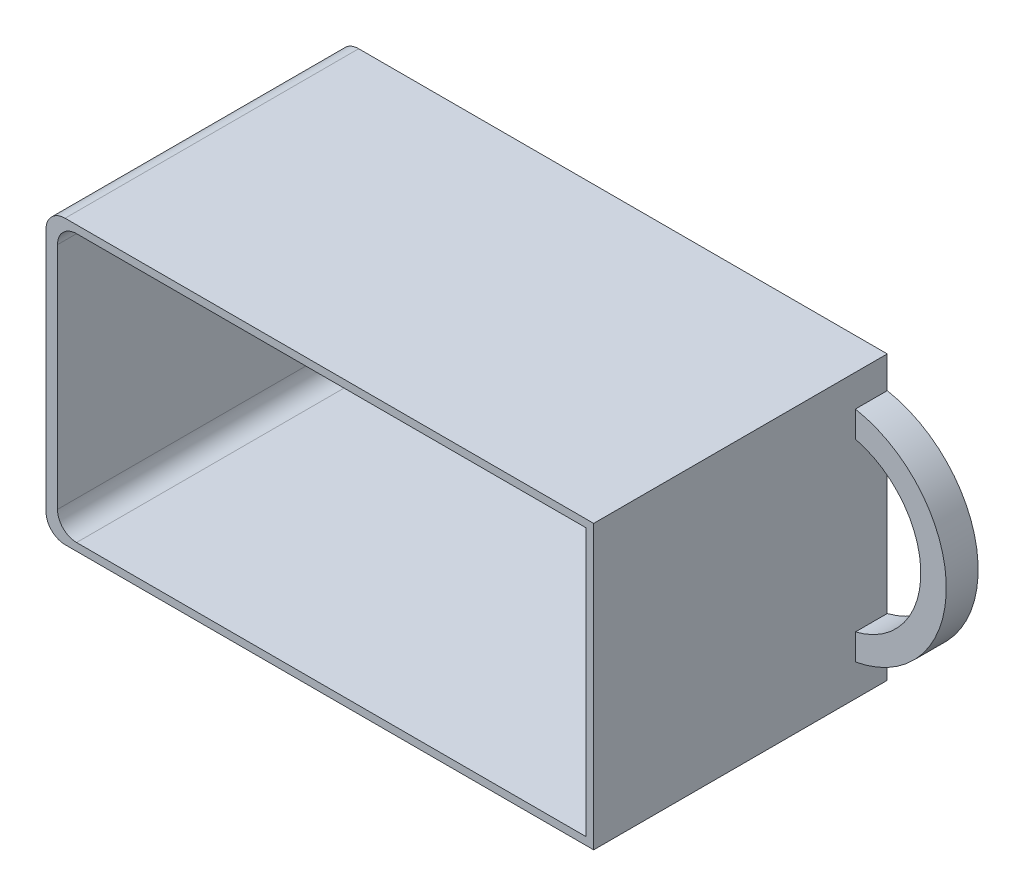
ISO-10303-21;
HEADER;
FILE_DESCRIPTION(('STEP AP214'),'2;1');
FILE_NAME('part.step','',(''),(''),'','','');
FILE_SCHEMA(('AUTOMOTIVE_DESIGN { 1 0 10303 214 1 1 1 1 }'));
ENDSEC;
DATA;
#1=APPLICATION_CONTEXT('core data for automotive mechanical design processes');
#2=APPLICATION_PROTOCOL_DEFINITION('international standard','automotive_design',2000,#1);
#3=PRODUCT_CONTEXT('',#1,'mechanical');
#4=PRODUCT('Part','Part','',(#3));
#5=PRODUCT_RELATED_PRODUCT_CATEGORY('part','',(#4));
#6=PRODUCT_DEFINITION_FORMATION('','',#4);
#7=PRODUCT_DEFINITION_CONTEXT('part definition',#1,'design');
#8=PRODUCT_DEFINITION('design','',#6,#7);
#9=PRODUCT_DEFINITION_SHAPE('','',#8);
#10=(LENGTH_UNIT() NAMED_UNIT(*) SI_UNIT(.MILLI.,.METRE.));
#11=(NAMED_UNIT(*) PLANE_ANGLE_UNIT() SI_UNIT($,.RADIAN.));
#12=(NAMED_UNIT(*) SI_UNIT($,.STERADIAN.) SOLID_ANGLE_UNIT());
#13=UNCERTAINTY_MEASURE_WITH_UNIT(LENGTH_MEASURE(1.E-05),#10,'distance_accuracy_value','');
#14=(GEOMETRIC_REPRESENTATION_CONTEXT(3) GLOBAL_UNCERTAINTY_ASSIGNED_CONTEXT((#13)) GLOBAL_UNIT_ASSIGNED_CONTEXT((#10,
#11,#12)) REPRESENTATION_CONTEXT('',''));
#15=CARTESIAN_POINT('',(0.,0.,0.));
#16=DIRECTION('',(0.,0.,1.));
#17=DIRECTION('',(1.,0.,0.));
#18=AXIS2_PLACEMENT_3D('',#15,#16,#17);
#19=CARTESIAN_POINT('',(43.,-22.2,46.1));
#20=DIRECTION('',(-1.,0.,0.));
#21=DIRECTION('',(0.,0.,1.));
#22=AXIS2_PLACEMENT_3D('',#19,#20,#21);
#23=PLANE('',#22);
#24=DIRECTION('',(0.,0.,-1.));
#25=VECTOR('',#24,1.);
#26=CARTESIAN_POINT('',(43.,-17.2,5.));
#27=LINE('',#26,#25);
#28=CARTESIAN_POINT('',(43.,-17.2,5.));
#29=VERTEX_POINT('',#28);
#30=CARTESIAN_POINT('',(43.,-17.2,0.));
#31=VERTEX_POINT('',#30);
#32=EDGE_CURVE('E191',#29,#31,#27,.T.);
#33=ORIENTED_EDGE('',*,*,#32,.F.);
#34=DIRECTION('',(0.,-1.,0.));
#35=VECTOR('',#34,1.);
#36=CARTESIAN_POINT('',(43.,-17.2,5.));
#37=LINE('',#36,#35);
#38=CARTESIAN_POINT('',(43.,-13.1087756865392,5.));
#39=VERTEX_POINT('',#38);
#40=EDGE_CURVE('E188',#39,#29,#37,.T.);
#41=ORIENTED_EDGE('',*,*,#40,.F.);
#42=DIRECTION('',(0.,0.,-1.));
#43=VECTOR('',#42,1.);
#44=CARTESIAN_POINT('',(43.,-13.1087756865392,5.));
#45=LINE('',#44,#43);
#46=CARTESIAN_POINT('',(43.,-13.1087756865392,0.));
#47=VERTEX_POINT('',#46);
#48=EDGE_CURVE('E200',#39,#47,#45,.T.);
#49=ORIENTED_EDGE('',*,*,#48,.T.);
#50=DIRECTION('',(0.,1.,0.));
#51=VECTOR('',#50,1.);
#52=CARTESIAN_POINT('',(43.,-22.2,0.));
#53=LINE('',#52,#51);
#54=CARTESIAN_POINT('',(43.,13.1087756865392,0.));
#55=VERTEX_POINT('',#54);
#56=EDGE_CURVE('E226',#47,#55,#53,.T.);
#57=ORIENTED_EDGE('',*,*,#56,.T.);
#58=DIRECTION('',(0.,0.,-1.));
#59=VECTOR('',#58,1.);
#60=CARTESIAN_POINT('',(43.,13.1087756865392,5.));
#61=LINE('',#60,#59);
#62=CARTESIAN_POINT('',(43.,13.1087756865392,5.));
#63=VERTEX_POINT('',#62);
#64=EDGE_CURVE('E203',#63,#55,#61,.T.);
#65=ORIENTED_EDGE('',*,*,#64,.F.);
#66=DIRECTION('',(0.,-1.,0.));
#67=VECTOR('',#66,1.);
#68=CARTESIAN_POINT('',(43.,13.1087756865392,5.));
#69=LINE('',#68,#67);
#70=CARTESIAN_POINT('',(43.,17.2,5.));
#71=VERTEX_POINT('',#70);
#72=EDGE_CURVE('E181',#71,#63,#69,.T.);
#73=ORIENTED_EDGE('',*,*,#72,.F.);
#74=DIRECTION('',(0.,0.,-1.));
#75=VECTOR('',#74,1.);
#76=CARTESIAN_POINT('',(43.,17.2,5.));
#77=LINE('',#76,#75);
#78=CARTESIAN_POINT('',(43.,17.2,0.));
#79=VERTEX_POINT('',#78);
#80=EDGE_CURVE('E206',#71,#79,#77,.T.);
#81=ORIENTED_EDGE('',*,*,#80,.T.);
#82=CARTESIAN_POINT('',(43.,22.2,0.));
#83=VERTEX_POINT('',#82);
#84=EDGE_CURVE('E209',#79,#83,#53,.T.);
#85=ORIENTED_EDGE('',*,*,#84,.T.);
#86=DIRECTION('',(0.,0.,-1.));
#87=VECTOR('',#86,1.);
#88=CARTESIAN_POINT('',(43.,22.2,46.1));
#89=LINE('',#88,#87);
#90=CARTESIAN_POINT('',(43.,22.2,46.1));
#91=VERTEX_POINT('',#90);
#92=EDGE_CURVE('E235',#91,#83,#89,.T.);
#93=ORIENTED_EDGE('',*,*,#92,.F.);
#94=DIRECTION('',(0.,1.,0.));
#95=VECTOR('',#94,1.);
#96=CARTESIAN_POINT('',(43.,-22.2,46.1));
#97=LINE('',#96,#95);
#98=CARTESIAN_POINT('',(43.,-22.2,46.1));
#99=VERTEX_POINT('',#98);
#100=EDGE_CURVE('E210',#99,#91,#97,.T.);
#101=ORIENTED_EDGE('',*,*,#100,.F.);
#102=DIRECTION('',(0.,0.,-1.));
#103=VECTOR('',#102,1.);
#104=CARTESIAN_POINT('',(43.,-22.2,46.1));
#105=LINE('',#104,#103);
#106=CARTESIAN_POINT('',(43.,-22.2,0.));
#107=VERTEX_POINT('',#106);
#108=EDGE_CURVE('E222',#99,#107,#105,.T.);
#109=ORIENTED_EDGE('',*,*,#108,.T.);
#110=EDGE_CURVE('E223',#107,#31,#53,.T.);
#111=ORIENTED_EDGE('',*,*,#110,.T.);
#112=EDGE_LOOP('',(#33,#41,#49,#57,#65,#73,#81,#85,#93,#101,#109,#111));
#113=FACE_BOUND('',#112,.T.);
#114=ADVANCED_FACE('F41',(#113),#23,.F.);
#115=CARTESIAN_POINT('',(-43.,22.2,46.1));
#116=DIRECTION('',(0.,-1.,0.));
#117=DIRECTION('',(0.,0.,-1.));
#118=AXIS2_PLACEMENT_3D('',#115,#116,#117);
#119=PLANE('',#118);
#120=DIRECTION('',(-1.,0.,0.));
#121=VECTOR('',#120,1.);
#122=CARTESIAN_POINT('',(-43.,22.2,0.));
#123=LINE('',#122,#121);
#124=CARTESIAN_POINT('',(-40.,22.2,0.));
#125=VERTEX_POINT('',#124);
#126=EDGE_CURVE('E225',#83,#125,#123,.T.);
#127=ORIENTED_EDGE('',*,*,#126,.T.);
#128=DIRECTION('',(0.,0.,-1.));
#129=VECTOR('',#128,1.);
#130=CARTESIAN_POINT('',(-40.,22.2,46.1));
#131=LINE('',#130,#129);
#132=CARTESIAN_POINT('',(-40.,22.2,46.1));
#133=VERTEX_POINT('',#132);
#134=EDGE_CURVE('E254',#125,#133,#131,.F.);
#135=ORIENTED_EDGE('',*,*,#134,.T.);
#136=DIRECTION('',(-1.,0.,0.));
#137=VECTOR('',#136,1.);
#138=CARTESIAN_POINT('',(-43.,22.2,46.1));
#139=LINE('',#138,#137);
#140=EDGE_CURVE('E213',#91,#133,#139,.T.);
#141=ORIENTED_EDGE('',*,*,#140,.F.);
#142=ORIENTED_EDGE('',*,*,#92,.T.);
#143=EDGE_LOOP('',(#127,#135,#141,#142));
#144=FACE_BOUND('',#143,.T.);
#145=ADVANCED_FACE('F297',(#144),#119,.F.);
#146=CARTESIAN_POINT('',(-43.,-22.2,46.1));
#147=DIRECTION('',(1.,0.,0.));
#148=DIRECTION('',(0.,0.,-1.));
#149=AXIS2_PLACEMENT_3D('',#146,#147,#148);
#150=PLANE('',#149);
#151=DIRECTION('',(0.,-1.,0.));
#152=VECTOR('',#151,1.);
#153=CARTESIAN_POINT('',(-43.,-22.2,0.));
#154=LINE('',#153,#152);
#155=CARTESIAN_POINT('',(-43.,19.2,0.));
#156=VERTEX_POINT('',#155);
#157=CARTESIAN_POINT('',(-43.,-19.2,0.));
#158=VERTEX_POINT('',#157);
#159=EDGE_CURVE('E229',#156,#158,#154,.T.);
#160=ORIENTED_EDGE('',*,*,#159,.T.);
#161=DIRECTION('',(0.,0.,-1.));
#162=VECTOR('',#161,1.);
#163=CARTESIAN_POINT('',(-43.,-19.2,46.1));
#164=LINE('',#163,#162);
#165=CARTESIAN_POINT('',(-43.,-19.2,46.1));
#166=VERTEX_POINT('',#165);
#167=EDGE_CURVE('E248',#158,#166,#164,.F.);
#168=ORIENTED_EDGE('',*,*,#167,.T.);
#169=DIRECTION('',(0.,-1.,0.));
#170=VECTOR('',#169,1.);
#171=CARTESIAN_POINT('',(-43.,-22.2,46.1));
#172=LINE('',#171,#170);
#173=CARTESIAN_POINT('',(-43.,19.2,46.1));
#174=VERTEX_POINT('',#173);
#175=EDGE_CURVE('E217',#174,#166,#172,.T.);
#176=ORIENTED_EDGE('',*,*,#175,.F.);
#177=DIRECTION('',(0.,0.,-1.));
#178=VECTOR('',#177,1.);
#179=CARTESIAN_POINT('',(-43.,19.2,46.1));
#180=LINE('',#179,#178);
#181=EDGE_CURVE('E245',#174,#156,#180,.T.);
#182=ORIENTED_EDGE('',*,*,#181,.T.);
#183=EDGE_LOOP('',(#160,#168,#176,#182));
#184=FACE_BOUND('',#183,.T.);
#185=ADVANCED_FACE('F303',(#184),#150,.F.);
#186=CARTESIAN_POINT('',(-43.,-22.2,46.1));
#187=DIRECTION('',(0.,1.,0.));
#188=DIRECTION('',(0.,0.,1.));
#189=AXIS2_PLACEMENT_3D('',#186,#187,#188);
#190=PLANE('',#189);
#191=DIRECTION('',(1.,0.,0.));
#192=VECTOR('',#191,1.);
#193=CARTESIAN_POINT('',(-43.,-22.2,46.1));
#194=LINE('',#193,#192);
#195=CARTESIAN_POINT('',(-40.,-22.2,46.1));
#196=VERTEX_POINT('',#195);
#197=EDGE_CURVE('E220',#196,#99,#194,.T.);
#198=ORIENTED_EDGE('',*,*,#197,.F.);
#199=DIRECTION('',(0.,0.,-1.));
#200=VECTOR('',#199,1.);
#201=CARTESIAN_POINT('',(-40.,-22.2,46.1));
#202=LINE('',#201,#200);
#203=CARTESIAN_POINT('',(-40.,-22.2,0.));
#204=VERTEX_POINT('',#203);
#205=EDGE_CURVE('E238',#196,#204,#202,.T.);
#206=ORIENTED_EDGE('',*,*,#205,.T.);
#207=DIRECTION('',(1.,0.,0.));
#208=VECTOR('',#207,1.);
#209=CARTESIAN_POINT('',(-43.,-22.2,0.));
#210=LINE('',#209,#208);
#211=EDGE_CURVE('E214',#204,#107,#210,.T.);
#212=ORIENTED_EDGE('',*,*,#211,.T.);
#213=ORIENTED_EDGE('',*,*,#108,.F.);
#214=EDGE_LOOP('',(#198,#206,#212,#213));
#215=FACE_BOUND('',#214,.T.);
#216=ADVANCED_FACE('F328',(#215),#190,.F.);
#217=CARTESIAN_POINT('',(0.,0.,46.1));
#218=DIRECTION('',(0.,0.,-1.));
#219=DIRECTION('',(-1.,0.,0.));
#220=AXIS2_PLACEMENT_3D('',#217,#218,#219);
#221=PLANE('',#220);
#222=DIRECTION('',(0.,1.,0.));
#223=VECTOR('',#222,1.);
#224=CARTESIAN_POINT('',(41.8,-21.,46.1));
#225=LINE('',#224,#223);
#226=CARTESIAN_POINT('',(41.8,-21.,46.1));
#227=VERTEX_POINT('',#226);
#228=CARTESIAN_POINT('',(41.8,21.,46.1));
#229=VERTEX_POINT('',#228);
#230=EDGE_CURVE('E276',#227,#229,#225,.T.);
#231=ORIENTED_EDGE('',*,*,#230,.F.);
#232=DIRECTION('',(1.,0.,0.));
#233=VECTOR('',#232,1.);
#234=CARTESIAN_POINT('',(-41.2,-21.,46.1));
#235=LINE('',#234,#233);
#236=CARTESIAN_POINT('',(-38.2,-21.,46.1));
#237=VERTEX_POINT('',#236);
#238=EDGE_CURVE('E174',#237,#227,#235,.T.);
#239=ORIENTED_EDGE('',*,*,#238,.F.);
#240=CARTESIAN_POINT('',(-38.2,-18.,46.1));
#241=DIRECTION('',(0.,0.,-1.));
#242=DIRECTION('',(-1.,0.,0.));
#243=AXIS2_PLACEMENT_3D('',#240,#241,#242);
#244=CIRCLE('',#243,3.);
#245=CARTESIAN_POINT('',(-41.2,-18.,46.1));
#246=VERTEX_POINT('',#245);
#247=EDGE_CURVE('E12',#237,#246,#244,.T.);
#248=ORIENTED_EDGE('',*,*,#247,.T.);
#249=DIRECTION('',(0.,-1.,0.));
#250=VECTOR('',#249,1.);
#251=CARTESIAN_POINT('',(-41.2,21.,46.1));
#252=LINE('',#251,#250);
#253=CARTESIAN_POINT('',(-41.2,18.,46.1));
#254=VERTEX_POINT('',#253);
#255=EDGE_CURVE('E272',#254,#246,#252,.T.);
#256=ORIENTED_EDGE('',*,*,#255,.F.);
#257=CARTESIAN_POINT('',(-38.2,18.,46.1));
#258=DIRECTION('',(0.,0.,-1.));
#259=DIRECTION('',(-1.,0.,0.));
#260=AXIS2_PLACEMENT_3D('',#257,#258,#259);
#261=CIRCLE('',#260,3.);
#262=CARTESIAN_POINT('',(-38.2,21.,46.1));
#263=VERTEX_POINT('',#262);
#264=EDGE_CURVE('E49',#254,#263,#261,.T.);
#265=ORIENTED_EDGE('',*,*,#264,.T.);
#266=DIRECTION('',(-1.,0.,0.));
#267=VECTOR('',#266,1.);
#268=CARTESIAN_POINT('',(41.8,21.,46.1));
#269=LINE('',#268,#267);
#270=EDGE_CURVE('E162',#229,#263,#269,.T.);
#271=ORIENTED_EDGE('',*,*,#270,.F.);
#272=EDGE_LOOP('',(#231,#239,#248,#256,#265,#271));
#273=FACE_BOUND('',#272,.T.);
#274=ORIENTED_EDGE('',*,*,#175,.T.);
#275=CARTESIAN_POINT('',(-40.,-19.2,46.1));
#276=DIRECTION('',(0.,0.,-1.));
#277=DIRECTION('',(-1.,0.,0.));
#278=AXIS2_PLACEMENT_3D('',#275,#276,#277);
#279=CIRCLE('',#278,3.);
#280=EDGE_CURVE('E252',#166,#196,#279,.F.);
#281=ORIENTED_EDGE('',*,*,#280,.T.);
#282=ORIENTED_EDGE('',*,*,#197,.T.);
#283=ORIENTED_EDGE('',*,*,#100,.T.);
#284=ORIENTED_EDGE('',*,*,#140,.T.);
#285=CARTESIAN_POINT('',(-40.,19.2,46.1));
#286=DIRECTION('',(0.,0.,-1.));
#287=DIRECTION('',(-1.,0.,0.));
#288=AXIS2_PLACEMENT_3D('',#285,#286,#287);
#289=CIRCLE('',#288,3.);
#290=EDGE_CURVE('E250',#133,#174,#289,.F.);
#291=ORIENTED_EDGE('',*,*,#290,.T.);
#292=EDGE_LOOP('',(#274,#281,#282,#283,#284,#291));
#293=FACE_BOUND('',#292,.T.);
#294=ADVANCED_FACE('F269',(#273,#293),#221,.F.);
#295=CARTESIAN_POINT('',(0.,0.,0.));
#296=DIRECTION('',(0.,0.,-1.));
#297=DIRECTION('',(-1.,0.,0.));
#298=AXIS2_PLACEMENT_3D('',#295,#296,#297);
#299=PLANE('',#298);
#300=CARTESIAN_POINT('',(39.7735468390197,0.,0.));
#301=DIRECTION('',(0.,0.,-1.));
#302=DIRECTION('',(1.,0.,0.));
#303=AXIS2_PLACEMENT_3D('',#300,#301,#302);
#304=CIRCLE('',#303,13.5);
#305=EDGE_CURVE('E182',#55,#47,#304,.T.);
#306=ORIENTED_EDGE('',*,*,#305,.F.);
#307=ORIENTED_EDGE('',*,*,#56,.F.);
#308=EDGE_LOOP('',(#306,#307));
#309=FACE_BOUND('',#308,.T.);
#310=ORIENTED_EDGE('',*,*,#211,.F.);
#311=CARTESIAN_POINT('',(-40.,-19.2,0.));
#312=DIRECTION('',(0.,0.,-1.));
#313=DIRECTION('',(-1.,0.,0.));
#314=AXIS2_PLACEMENT_3D('',#311,#312,#313);
#315=CIRCLE('',#314,3.);
#316=EDGE_CURVE('E243',#204,#158,#315,.T.);
#317=ORIENTED_EDGE('',*,*,#316,.T.);
#318=ORIENTED_EDGE('',*,*,#159,.F.);
#319=CARTESIAN_POINT('',(-40.,19.2,0.));
#320=DIRECTION('',(0.,0.,-1.));
#321=DIRECTION('',(-1.,0.,0.));
#322=AXIS2_PLACEMENT_3D('',#319,#320,#321);
#323=CIRCLE('',#322,3.);
#324=EDGE_CURVE('E241',#156,#125,#323,.T.);
#325=ORIENTED_EDGE('',*,*,#324,.T.);
#326=ORIENTED_EDGE('',*,*,#126,.F.);
#327=ORIENTED_EDGE('',*,*,#84,.F.);
#328=CARTESIAN_POINT('',(39.7735468390197,0.,0.));
#329=DIRECTION('',(0.,0.,1.));
#330=DIRECTION('',(1.,0.,0.));
#331=AXIS2_PLACEMENT_3D('',#328,#329,#330);
#332=CIRCLE('',#331,17.5);
#333=EDGE_CURVE('E192',#31,#79,#332,.T.);
#334=ORIENTED_EDGE('',*,*,#333,.F.);
#335=ORIENTED_EDGE('',*,*,#110,.F.);
#336=EDGE_LOOP('',(#310,#317,#318,#325,#326,#327,#334,#335));
#337=FACE_BOUND('',#336,.T.);
#338=ADVANCED_FACE('F335',(#309,#337),#299,.T.);
#339=CARTESIAN_POINT('',(39.7735468390197,0.,5.));
#340=DIRECTION('',(0.,0.,-1.));
#341=DIRECTION('',(-1.,0.,0.));
#342=AXIS2_PLACEMENT_3D('',#339,#340,#341);
#343=CYLINDRICAL_SURFACE('',#342,17.5);
#344=ORIENTED_EDGE('',*,*,#333,.T.);
#345=ORIENTED_EDGE('',*,*,#80,.F.);
#346=CARTESIAN_POINT('',(39.7735468390197,0.,5.));
#347=DIRECTION('',(0.,0.,1.));
#348=DIRECTION('',(1.,0.,0.));
#349=AXIS2_PLACEMENT_3D('',#346,#347,#348);
#350=CIRCLE('',#349,17.5);
#351=EDGE_CURVE('E178',#29,#71,#350,.T.);
#352=ORIENTED_EDGE('',*,*,#351,.F.);
#353=ORIENTED_EDGE('',*,*,#32,.T.);
#354=EDGE_LOOP('',(#344,#345,#352,#353));
#355=FACE_BOUND('',#354,.T.);
#356=ADVANCED_FACE('F339',(#355),#343,.T.);
#357=CARTESIAN_POINT('',(39.7735468390197,0.,5.));
#358=DIRECTION('',(0.,0.,-1.));
#359=DIRECTION('',(-1.,0.,0.));
#360=AXIS2_PLACEMENT_3D('',#357,#358,#359);
#361=CYLINDRICAL_SURFACE('',#360,13.5);
#362=ORIENTED_EDGE('',*,*,#305,.T.);
#363=ORIENTED_EDGE('',*,*,#48,.F.);
#364=CARTESIAN_POINT('',(39.7735468390197,0.,5.));
#365=DIRECTION('',(0.,0.,-1.));
#366=DIRECTION('',(1.,0.,0.));
#367=AXIS2_PLACEMENT_3D('',#364,#365,#366);
#368=CIRCLE('',#367,13.5);
#369=EDGE_CURVE('E185',#63,#39,#368,.T.);
#370=ORIENTED_EDGE('',*,*,#369,.F.);
#371=ORIENTED_EDGE('',*,*,#64,.T.);
#372=EDGE_LOOP('',(#362,#363,#370,#371));
#373=FACE_BOUND('',#372,.T.);
#374=ADVANCED_FACE('F347',(#373),#361,.F.);
#375=CARTESIAN_POINT('',(39.7735468390197,0.,5.));
#376=DIRECTION('',(0.,0.,1.));
#377=DIRECTION('',(1.,0.,0.));
#378=AXIS2_PLACEMENT_3D('',#375,#376,#377);
#379=PLANE('',#378);
#380=ORIENTED_EDGE('',*,*,#351,.T.);
#381=ORIENTED_EDGE('',*,*,#72,.T.);
#382=ORIENTED_EDGE('',*,*,#369,.T.);
#383=ORIENTED_EDGE('',*,*,#40,.T.);
#384=EDGE_LOOP('',(#380,#381,#382,#383));
#385=FACE_BOUND('',#384,.T.);
#386=ADVANCED_FACE('F342',(#385),#379,.T.);
#387=CARTESIAN_POINT('',(0.,0.,1.2));
#388=DIRECTION('',(0.,0.,-1.));
#389=DIRECTION('',(-1.,0.,0.));
#390=AXIS2_PLACEMENT_3D('',#387,#388,#389);
#391=PLANE('',#390);
#392=DIRECTION('',(-1.,0.,0.));
#393=VECTOR('',#392,1.);
#394=CARTESIAN_POINT('',(41.8,21.,1.20000000000001));
#395=LINE('',#394,#393);
#396=CARTESIAN_POINT('',(41.8,21.,1.20000000000001));
#397=VERTEX_POINT('',#396);
#398=CARTESIAN_POINT('',(-38.2,21.,1.20000000000001));
#399=VERTEX_POINT('',#398);
#400=EDGE_CURVE('E281',#397,#399,#395,.T.);
#401=ORIENTED_EDGE('',*,*,#400,.T.);
#402=CARTESIAN_POINT('',(-38.2,18.,1.20000000000001));
#403=DIRECTION('',(0.,0.,-1.));
#404=DIRECTION('',(-1.,0.,0.));
#405=AXIS2_PLACEMENT_3D('',#402,#403,#404);
#406=CIRCLE('',#405,3.);
#407=CARTESIAN_POINT('',(-41.2,18.,1.20000000000001));
#408=VERTEX_POINT('',#407);
#409=EDGE_CURVE('E263',#399,#408,#406,.F.);
#410=ORIENTED_EDGE('',*,*,#409,.T.);
#411=DIRECTION('',(0.,-1.,0.));
#412=VECTOR('',#411,1.);
#413=CARTESIAN_POINT('',(-41.2,21.,1.20000000000001));
#414=LINE('',#413,#412);
#415=CARTESIAN_POINT('',(-41.2,-18.,1.20000000000001));
#416=VERTEX_POINT('',#415);
#417=EDGE_CURVE('E195',#408,#416,#414,.T.);
#418=ORIENTED_EDGE('',*,*,#417,.T.);
#419=CARTESIAN_POINT('',(-38.2,-18.,1.20000000000001));
#420=DIRECTION('',(0.,0.,-1.));
#421=DIRECTION('',(-1.,0.,0.));
#422=AXIS2_PLACEMENT_3D('',#419,#420,#421);
#423=CIRCLE('',#422,3.);
#424=CARTESIAN_POINT('',(-38.2,-21.,1.20000000000001));
#425=VERTEX_POINT('',#424);
#426=EDGE_CURVE('E56',#416,#425,#423,.F.);
#427=ORIENTED_EDGE('',*,*,#426,.T.);
#428=DIRECTION('',(1.,0.,0.));
#429=VECTOR('',#428,1.);
#430=CARTESIAN_POINT('',(-41.2,-21.,1.20000000000001));
#431=LINE('',#430,#429);
#432=CARTESIAN_POINT('',(41.8,-21.,1.19999999999998));
#433=VERTEX_POINT('',#432);
#434=EDGE_CURVE('E153',#425,#433,#431,.T.);
#435=ORIENTED_EDGE('',*,*,#434,.T.);
#436=DIRECTION('',(0.,1.,0.));
#437=VECTOR('',#436,1.);
#438=CARTESIAN_POINT('',(41.8,-21.,1.20000000000001));
#439=LINE('',#438,#437);
#440=EDGE_CURVE('E156',#433,#397,#439,.T.);
#441=ORIENTED_EDGE('',*,*,#440,.T.);
#442=EDGE_LOOP('',(#401,#410,#418,#427,#435,#441));
#443=FACE_BOUND('',#442,.T.);
#444=ADVANCED_FACE('F155',(#443),#391,.F.);
#445=CARTESIAN_POINT('',(-41.2,-21.,-93.0215028904608));
#446=DIRECTION('',(0.,-1.,0.));
#447=DIRECTION('',(0.,0.,-1.));
#448=AXIS2_PLACEMENT_3D('',#445,#446,#447);
#449=PLANE('',#448);
#450=ORIENTED_EDGE('',*,*,#434,.F.);
#451=DIRECTION('',(0.,0.,1.));
#452=VECTOR('',#451,1.);
#453=CARTESIAN_POINT('',(-38.2,-21.,46.1));
#454=LINE('',#453,#452);
#455=EDGE_CURVE('E265',#425,#237,#454,.T.);
#456=ORIENTED_EDGE('',*,*,#455,.T.);
#457=ORIENTED_EDGE('',*,*,#238,.T.);
#458=DIRECTION('',(0.,0.,1.));
#459=VECTOR('',#458,1.);
#460=CARTESIAN_POINT('',(41.8,-21.,-93.0215028904608));
#461=LINE('',#460,#459);
#462=EDGE_CURVE('E161',#433,#227,#461,.T.);
#463=ORIENTED_EDGE('',*,*,#462,.F.);
#464=EDGE_LOOP('',(#450,#456,#457,#463));
#465=FACE_BOUND('',#464,.T.);
#466=ADVANCED_FACE('F172',(#465),#449,.F.);
#467=CARTESIAN_POINT('',(41.8,-21.,-93.0215028904608));
#468=DIRECTION('',(1.,0.,0.));
#469=DIRECTION('',(0.,1.,0.));
#470=AXIS2_PLACEMENT_3D('',#467,#468,#469);
#471=PLANE('',#470);
#472=ORIENTED_EDGE('',*,*,#462,.T.);
#473=ORIENTED_EDGE('',*,*,#230,.T.);
#474=DIRECTION('',(0.,0.,1.));
#475=VECTOR('',#474,1.);
#476=CARTESIAN_POINT('',(41.8,21.,-93.0215028904608));
#477=LINE('',#476,#475);
#478=EDGE_CURVE('E170',#397,#229,#477,.T.);
#479=ORIENTED_EDGE('',*,*,#478,.F.);
#480=ORIENTED_EDGE('',*,*,#440,.F.);
#481=EDGE_LOOP('',(#472,#473,#479,#480));
#482=FACE_BOUND('',#481,.T.);
#483=ADVANCED_FACE('F167',(#482),#471,.F.);
#484=CARTESIAN_POINT('',(41.8,21.,-93.0215028904608));
#485=DIRECTION('',(0.,1.,0.));
#486=DIRECTION('',(0.,0.,1.));
#487=AXIS2_PLACEMENT_3D('',#484,#485,#486);
#488=PLANE('',#487);
#489=ORIENTED_EDGE('',*,*,#270,.T.);
#490=DIRECTION('',(0.,0.,1.));
#491=VECTOR('',#490,1.);
#492=CARTESIAN_POINT('',(-38.2,21.,1.20000000000001));
#493=LINE('',#492,#491);
#494=EDGE_CURVE('E64',#263,#399,#493,.F.);
#495=ORIENTED_EDGE('',*,*,#494,.T.);
#496=ORIENTED_EDGE('',*,*,#400,.F.);
#497=ORIENTED_EDGE('',*,*,#478,.T.);
#498=EDGE_LOOP('',(#489,#495,#496,#497));
#499=FACE_BOUND('',#498,.T.);
#500=ADVANCED_FACE('F275',(#499),#488,.F.);
#501=CARTESIAN_POINT('',(-41.2,21.,-93.0215028904608));
#502=DIRECTION('',(-1.,0.,0.));
#503=DIRECTION('',(0.,0.,1.));
#504=AXIS2_PLACEMENT_3D('',#501,#502,#503);
#505=PLANE('',#504);
#506=ORIENTED_EDGE('',*,*,#417,.F.);
#507=DIRECTION('',(0.,0.,1.));
#508=VECTOR('',#507,1.);
#509=CARTESIAN_POINT('',(-41.2,18.,46.1));
#510=LINE('',#509,#508);
#511=EDGE_CURVE('E258',#408,#254,#510,.T.);
#512=ORIENTED_EDGE('',*,*,#511,.T.);
#513=ORIENTED_EDGE('',*,*,#255,.T.);
#514=DIRECTION('',(0.,0.,1.));
#515=VECTOR('',#514,1.);
#516=CARTESIAN_POINT('',(-41.2,-18.,1.20000000000001));
#517=LINE('',#516,#515);
#518=EDGE_CURVE('E256',#246,#416,#517,.F.);
#519=ORIENTED_EDGE('',*,*,#518,.T.);
#520=EDGE_LOOP('',(#506,#512,#513,#519));
#521=FACE_BOUND('',#520,.T.);
#522=ADVANCED_FACE('F283',(#521),#505,.F.);
#523=CARTESIAN_POINT('',(-40.,-19.2,46.1));
#524=DIRECTION('',(0.,0.,-1.));
#525=DIRECTION('',(-1.,0.,0.));
#526=AXIS2_PLACEMENT_3D('',#523,#524,#525);
#527=CYLINDRICAL_SURFACE('',#526,3.);
#528=ORIENTED_EDGE('',*,*,#280,.F.);
#529=ORIENTED_EDGE('',*,*,#167,.F.);
#530=ORIENTED_EDGE('',*,*,#316,.F.);
#531=ORIENTED_EDGE('',*,*,#205,.F.);
#532=EDGE_LOOP('',(#528,#529,#530,#531));
#533=FACE_BOUND('',#532,.T.);
#534=ADVANCED_FACE('F308',(#533),#527,.T.);
#535=CARTESIAN_POINT('',(-40.,19.2,46.1));
#536=DIRECTION('',(0.,0.,-1.));
#537=DIRECTION('',(-1.,0.,0.));
#538=AXIS2_PLACEMENT_3D('',#535,#536,#537);
#539=CYLINDRICAL_SURFACE('',#538,3.);
#540=ORIENTED_EDGE('',*,*,#290,.F.);
#541=ORIENTED_EDGE('',*,*,#134,.F.);
#542=ORIENTED_EDGE('',*,*,#324,.F.);
#543=ORIENTED_EDGE('',*,*,#181,.F.);
#544=EDGE_LOOP('',(#540,#541,#542,#543));
#545=FACE_BOUND('',#544,.T.);
#546=ADVANCED_FACE('F295',(#545),#539,.T.);
#547=CARTESIAN_POINT('',(-38.2,18.,-93.0215028904608));
#548=DIRECTION('',(0.,0.,-1.));
#549=DIRECTION('',(-1.,0.,0.));
#550=AXIS2_PLACEMENT_3D('',#547,#548,#549);
#551=CYLINDRICAL_SURFACE('',#550,3.);
#552=ORIENTED_EDGE('',*,*,#409,.F.);
#553=ORIENTED_EDGE('',*,*,#494,.F.);
#554=ORIENTED_EDGE('',*,*,#264,.F.);
#555=ORIENTED_EDGE('',*,*,#511,.F.);
#556=EDGE_LOOP('',(#552,#553,#554,#555));
#557=FACE_BOUND('',#556,.T.);
#558=ADVANCED_FACE('F279',(#557),#551,.F.);
#559=CARTESIAN_POINT('',(-38.2,-18.,-93.0215028904608));
#560=DIRECTION('',(0.,0.,-1.));
#561=DIRECTION('',(-1.,0.,0.));
#562=AXIS2_PLACEMENT_3D('',#559,#560,#561);
#563=CYLINDRICAL_SURFACE('',#562,3.);
#564=ORIENTED_EDGE('',*,*,#426,.F.);
#565=ORIENTED_EDGE('',*,*,#518,.F.);
#566=ORIENTED_EDGE('',*,*,#247,.F.);
#567=ORIENTED_EDGE('',*,*,#455,.F.);
#568=EDGE_LOOP('',(#564,#565,#566,#567));
#569=FACE_BOUND('',#568,.T.);
#570=ADVANCED_FACE('F43',(#569),#563,.F.);
#571=CLOSED_SHELL('',(#114,#145,#185,#216,#294,#338,#356,#374,#386,#444,#466,#483,#500,#522,
#534,#546,#558,#570));
#572=MANIFOLD_SOLID_BREP('B2',#571);
#573=ADVANCED_BREP_SHAPE_REPRESENTATION('',(#18,#572),#14);
#574=SHAPE_DEFINITION_REPRESENTATION(#9,#573);
ENDSEC;
END-ISO-10303-21;
